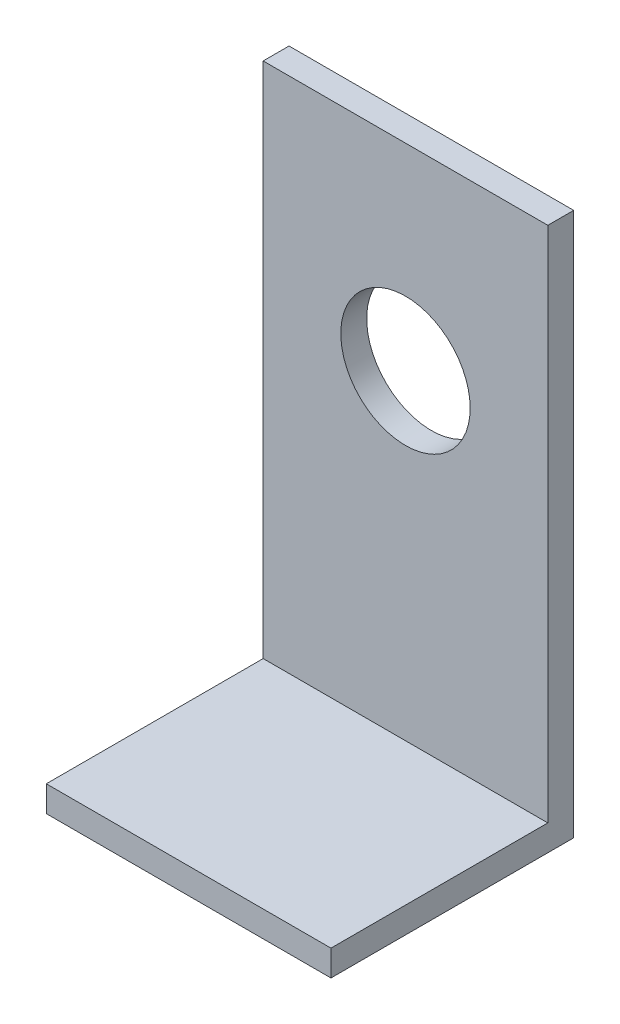
ISO-10303-21;
HEADER;
FILE_DESCRIPTION(('STEP AP214'),'2;1');
FILE_NAME('part.step','',(''),(''),'','','');
FILE_SCHEMA(('AUTOMOTIVE_DESIGN { 1 0 10303 214 1 1 1 1 }'));
ENDSEC;
DATA;
#1=APPLICATION_CONTEXT('core data for automotive mechanical design processes');
#2=APPLICATION_PROTOCOL_DEFINITION('international standard','automotive_design',2000,#1);
#3=PRODUCT_CONTEXT('',#1,'mechanical');
#4=PRODUCT('Part','Part','',(#3));
#5=PRODUCT_RELATED_PRODUCT_CATEGORY('part','',(#4));
#6=PRODUCT_DEFINITION_FORMATION('','',#4);
#7=PRODUCT_DEFINITION_CONTEXT('part definition',#1,'design');
#8=PRODUCT_DEFINITION('design','',#6,#7);
#9=PRODUCT_DEFINITION_SHAPE('','',#8);
#10=(LENGTH_UNIT() NAMED_UNIT(*) SI_UNIT(.MILLI.,.METRE.));
#11=(NAMED_UNIT(*) PLANE_ANGLE_UNIT() SI_UNIT($,.RADIAN.));
#12=(NAMED_UNIT(*) SI_UNIT($,.STERADIAN.) SOLID_ANGLE_UNIT());
#13=UNCERTAINTY_MEASURE_WITH_UNIT(LENGTH_MEASURE(1.E-05),#10,'distance_accuracy_value','');
#14=(GEOMETRIC_REPRESENTATION_CONTEXT(3) GLOBAL_UNCERTAINTY_ASSIGNED_CONTEXT((#13)) GLOBAL_UNIT_ASSIGNED_CONTEXT((#10,
#11,#12)) REPRESENTATION_CONTEXT('',''));
#15=CARTESIAN_POINT('',(0.,0.,0.));
#16=DIRECTION('',(0.,0.,1.));
#17=DIRECTION('',(1.,0.,0.));
#18=AXIS2_PLACEMENT_3D('',#15,#16,#17);
#19=CARTESIAN_POINT('',(0.,0.,5.));
#20=DIRECTION('',(0.,0.,-1.));
#21=DIRECTION('',(-1.,0.,0.));
#22=AXIS2_PLACEMENT_3D('',#19,#20,#21);
#23=PLANE('',#22);
#24=CARTESIAN_POINT('',(0.,66.9,5.));
#25=DIRECTION('',(0.,0.,1.));
#26=DIRECTION('',(1.,0.,0.));
#27=AXIS2_PLACEMENT_3D('',#24,#25,#26);
#28=CIRCLE('',#27,12.5);
#29=CARTESIAN_POINT('',(12.5,66.9,5.));
#30=VERTEX_POINT('',#29);
#31=EDGE_CURVE('E117',#30,#30,#28,.T.);
#32=ORIENTED_EDGE('',*,*,#31,.F.);
#33=EDGE_LOOP('',(#32));
#34=FACE_BOUND('',#33,.T.);
#35=DIRECTION('',(-1.,0.,0.));
#36=VECTOR('',#35,1.);
#37=CARTESIAN_POINT('',(-27.5,5.,5.));
#38=LINE('',#37,#36);
#39=CARTESIAN_POINT('',(27.5,4.99999999999999,5.));
#40=VERTEX_POINT('',#39);
#41=CARTESIAN_POINT('',(-27.5,5.,5.));
#42=VERTEX_POINT('',#41);
#43=EDGE_CURVE('E54',#40,#42,#38,.T.);
#44=ORIENTED_EDGE('',*,*,#43,.F.);
#45=DIRECTION('',(0.,1.,0.));
#46=VECTOR('',#45,1.);
#47=CARTESIAN_POINT('',(27.5,105.,5.));
#48=LINE('',#47,#46);
#49=CARTESIAN_POINT('',(27.5,105.,5.));
#50=VERTEX_POINT('',#49);
#51=EDGE_CURVE('E59',#40,#50,#48,.T.);
#52=ORIENTED_EDGE('',*,*,#51,.T.);
#53=DIRECTION('',(-1.,0.,0.));
#54=VECTOR('',#53,1.);
#55=CARTESIAN_POINT('',(-27.5,105.,5.));
#56=LINE('',#55,#54);
#57=CARTESIAN_POINT('',(-27.5,105.,5.));
#58=VERTEX_POINT('',#57);
#59=EDGE_CURVE('E97',#50,#58,#56,.T.);
#60=ORIENTED_EDGE('',*,*,#59,.T.);
#61=DIRECTION('',(0.,-1.,0.));
#62=VECTOR('',#61,1.);
#63=CARTESIAN_POINT('',(-27.5,0.,5.));
#64=LINE('',#63,#62);
#65=EDGE_CURVE('E103',#58,#42,#64,.T.);
#66=ORIENTED_EDGE('',*,*,#65,.T.);
#67=EDGE_LOOP('',(#44,#52,#60,#66));
#68=FACE_BOUND('',#67,.T.);
#69=ADVANCED_FACE('F39',(#34,#68),#23,.F.);
#70=CARTESIAN_POINT('',(0.,0.,0.));
#71=DIRECTION('',(0.,0.,-1.));
#72=DIRECTION('',(-1.,0.,0.));
#73=AXIS2_PLACEMENT_3D('',#70,#71,#72);
#74=PLANE('',#73);
#75=DIRECTION('',(0.,-1.,0.));
#76=VECTOR('',#75,1.);
#77=CARTESIAN_POINT('',(-27.5,0.,0.));
#78=LINE('',#77,#76);
#79=CARTESIAN_POINT('',(-27.5,105.,0.));
#80=VERTEX_POINT('',#79);
#81=CARTESIAN_POINT('',(-27.5,0.,0.));
#82=VERTEX_POINT('',#81);
#83=EDGE_CURVE('E101',#80,#82,#78,.T.);
#84=ORIENTED_EDGE('',*,*,#83,.F.);
#85=DIRECTION('',(-1.,0.,0.));
#86=VECTOR('',#85,1.);
#87=CARTESIAN_POINT('',(0.,105.,0.));
#88=LINE('',#87,#86);
#89=CARTESIAN_POINT('',(27.5,105.,0.));
#90=VERTEX_POINT('',#89);
#91=EDGE_CURVE('E90',#90,#80,#88,.T.);
#92=ORIENTED_EDGE('',*,*,#91,.F.);
#93=DIRECTION('',(0.,1.,0.));
#94=VECTOR('',#93,1.);
#95=CARTESIAN_POINT('',(27.5,105.,0.));
#96=LINE('',#95,#94);
#97=CARTESIAN_POINT('',(27.5,0.,0.));
#98=VERTEX_POINT('',#97);
#99=EDGE_CURVE('E80',#98,#90,#96,.T.);
#100=ORIENTED_EDGE('',*,*,#99,.F.);
#101=DIRECTION('',(1.,0.,0.));
#102=VECTOR('',#101,1.);
#103=CARTESIAN_POINT('',(27.5,0.,0.));
#104=LINE('',#103,#102);
#105=EDGE_CURVE('E91',#82,#98,#104,.T.);
#106=ORIENTED_EDGE('',*,*,#105,.F.);
#107=EDGE_LOOP('',(#84,#92,#100,#106));
#108=FACE_BOUND('',#107,.T.);
#109=CARTESIAN_POINT('',(0.,66.9,0.));
#110=DIRECTION('',(0.,0.,1.));
#111=DIRECTION('',(1.,0.,0.));
#112=AXIS2_PLACEMENT_3D('',#109,#110,#111);
#113=CIRCLE('',#112,12.5);
#114=CARTESIAN_POINT('',(12.5,66.9,0.));
#115=VERTEX_POINT('',#114);
#116=EDGE_CURVE('E122',#115,#115,#113,.T.);
#117=ORIENTED_EDGE('',*,*,#116,.T.);
#118=EDGE_LOOP('',(#117));
#119=FACE_BOUND('',#118,.T.);
#120=ADVANCED_FACE('F99',(#108,#119),#74,.T.);
#121=CARTESIAN_POINT('',(-27.5,0.,5.));
#122=DIRECTION('',(1.,0.,0.));
#123=DIRECTION('',(0.,1.,0.));
#124=AXIS2_PLACEMENT_3D('',#121,#122,#123);
#125=PLANE('',#124);
#126=ORIENTED_EDGE('',*,*,#83,.T.);
#127=DIRECTION('',(0.,0.,-1.));
#128=VECTOR('',#127,1.);
#129=CARTESIAN_POINT('',(-27.5,0.,5.));
#130=LINE('',#129,#128);
#131=CARTESIAN_POINT('',(-27.5,0.,46.9));
#132=VERTEX_POINT('',#131);
#133=EDGE_CURVE('E47',#132,#82,#130,.T.);
#134=ORIENTED_EDGE('',*,*,#133,.F.);
#135=DIRECTION('',(0.,-1.,0.));
#136=VECTOR('',#135,1.);
#137=CARTESIAN_POINT('',(-27.5,0.,46.9));
#138=LINE('',#137,#136);
#139=CARTESIAN_POINT('',(-27.5,5.,46.9));
#140=VERTEX_POINT('',#139);
#141=EDGE_CURVE('E133',#140,#132,#138,.T.);
#142=ORIENTED_EDGE('',*,*,#141,.F.);
#143=DIRECTION('',(0.,0.,-1.));
#144=VECTOR('',#143,1.);
#145=CARTESIAN_POINT('',(-27.5,5.,46.9));
#146=LINE('',#145,#144);
#147=EDGE_CURVE('E130',#140,#42,#146,.T.);
#148=ORIENTED_EDGE('',*,*,#147,.T.);
#149=ORIENTED_EDGE('',*,*,#65,.F.);
#150=DIRECTION('',(0.,0.,-1.));
#151=VECTOR('',#150,1.);
#152=CARTESIAN_POINT('',(-27.5,105.,5.));
#153=LINE('',#152,#151);
#154=EDGE_CURVE('E11',#58,#80,#153,.T.);
#155=ORIENTED_EDGE('',*,*,#154,.T.);
#156=EDGE_LOOP('',(#126,#134,#142,#148,#149,#155));
#157=FACE_BOUND('',#156,.T.);
#158=ADVANCED_FACE('F41',(#157),#125,.F.);
#159=CARTESIAN_POINT('',(27.5,0.,5.));
#160=DIRECTION('',(0.,1.,0.));
#161=DIRECTION('',(-1.,0.,0.));
#162=AXIS2_PLACEMENT_3D('',#159,#160,#161);
#163=PLANE('',#162);
#164=ORIENTED_EDGE('',*,*,#105,.T.);
#165=DIRECTION('',(0.,0.,-1.));
#166=VECTOR('',#165,1.);
#167=CARTESIAN_POINT('',(27.5,0.,5.));
#168=LINE('',#167,#166);
#169=CARTESIAN_POINT('',(27.5,0.,46.9));
#170=VERTEX_POINT('',#169);
#171=EDGE_CURVE('E86',#170,#98,#168,.T.);
#172=ORIENTED_EDGE('',*,*,#171,.F.);
#173=DIRECTION('',(1.,0.,0.));
#174=VECTOR('',#173,1.);
#175=CARTESIAN_POINT('',(27.5,0.,46.9));
#176=LINE('',#175,#174);
#177=EDGE_CURVE('E113',#132,#170,#176,.T.);
#178=ORIENTED_EDGE('',*,*,#177,.F.);
#179=ORIENTED_EDGE('',*,*,#133,.T.);
#180=EDGE_LOOP('',(#164,#172,#178,#179));
#181=FACE_BOUND('',#180,.T.);
#182=ADVANCED_FACE('F111',(#181),#163,.F.);
#183=CARTESIAN_POINT('',(27.5,105.,5.));
#184=DIRECTION('',(-1.,0.,0.));
#185=DIRECTION('',(0.,-1.,0.));
#186=AXIS2_PLACEMENT_3D('',#183,#184,#185);
#187=PLANE('',#186);
#188=ORIENTED_EDGE('',*,*,#99,.T.);
#189=DIRECTION('',(0.,0.,-1.));
#190=VECTOR('',#189,1.);
#191=CARTESIAN_POINT('',(27.5,105.,5.));
#192=LINE('',#191,#190);
#193=EDGE_CURVE('E83',#50,#90,#192,.T.);
#194=ORIENTED_EDGE('',*,*,#193,.F.);
#195=ORIENTED_EDGE('',*,*,#51,.F.);
#196=DIRECTION('',(0.,0.,-1.));
#197=VECTOR('',#196,1.);
#198=CARTESIAN_POINT('',(27.5,5.,46.9));
#199=LINE('',#198,#197);
#200=CARTESIAN_POINT('',(27.5,5.,46.9));
#201=VERTEX_POINT('',#200);
#202=EDGE_CURVE('E125',#201,#40,#199,.T.);
#203=ORIENTED_EDGE('',*,*,#202,.F.);
#204=DIRECTION('',(0.,1.,0.));
#205=VECTOR('',#204,1.);
#206=CARTESIAN_POINT('',(27.5,5.,46.9));
#207=LINE('',#206,#205);
#208=EDGE_CURVE('E139',#170,#201,#207,.T.);
#209=ORIENTED_EDGE('',*,*,#208,.F.);
#210=ORIENTED_EDGE('',*,*,#171,.T.);
#211=EDGE_LOOP('',(#188,#194,#195,#203,#209,#210));
#212=FACE_BOUND('',#211,.T.);
#213=ADVANCED_FACE('F82',(#212),#187,.F.);
#214=CARTESIAN_POINT('',(0.,105.,5.));
#215=DIRECTION('',(0.,-1.,0.));
#216=DIRECTION('',(1.,0.,0.));
#217=AXIS2_PLACEMENT_3D('',#214,#215,#216);
#218=PLANE('',#217);
#219=ORIENTED_EDGE('',*,*,#91,.T.);
#220=ORIENTED_EDGE('',*,*,#154,.F.);
#221=ORIENTED_EDGE('',*,*,#59,.F.);
#222=ORIENTED_EDGE('',*,*,#193,.T.);
#223=EDGE_LOOP('',(#219,#220,#221,#222));
#224=FACE_BOUND('',#223,.T.);
#225=ADVANCED_FACE('F94',(#224),#218,.F.);
#226=CARTESIAN_POINT('',(0.,66.9,5.));
#227=DIRECTION('',(0.,0.,-1.));
#228=DIRECTION('',(-1.,0.,0.));
#229=AXIS2_PLACEMENT_3D('',#226,#227,#228);
#230=CYLINDRICAL_SURFACE('',#229,12.5);
#231=ORIENTED_EDGE('',*,*,#31,.T.);
#232=EDGE_LOOP('',(#231));
#233=FACE_BOUND('',#232,.T.);
#234=ORIENTED_EDGE('',*,*,#116,.F.);
#235=EDGE_LOOP('',(#234));
#236=FACE_BOUND('',#235,.T.);
#237=ADVANCED_FACE('F171',(#233,#236),#230,.F.);
#238=CARTESIAN_POINT('',(-27.5,5.,46.9));
#239=DIRECTION('',(0.,-1.,0.));
#240=DIRECTION('',(0.,0.,-1.));
#241=AXIS2_PLACEMENT_3D('',#238,#239,#240);
#242=PLANE('',#241);
#243=ORIENTED_EDGE('',*,*,#43,.T.);
#244=ORIENTED_EDGE('',*,*,#147,.F.);
#245=DIRECTION('',(-1.,0.,0.));
#246=VECTOR('',#245,1.);
#247=CARTESIAN_POINT('',(-27.5,5.,46.9));
#248=LINE('',#247,#246);
#249=EDGE_CURVE('E136',#201,#140,#248,.T.);
#250=ORIENTED_EDGE('',*,*,#249,.F.);
#251=ORIENTED_EDGE('',*,*,#202,.T.);
#252=EDGE_LOOP('',(#243,#244,#250,#251));
#253=FACE_BOUND('',#252,.T.);
#254=ADVANCED_FACE('F156',(#253),#242,.F.);
#255=CARTESIAN_POINT('',(0.,0.,46.9));
#256=DIRECTION('',(0.,0.,-1.));
#257=DIRECTION('',(-1.,0.,0.));
#258=AXIS2_PLACEMENT_3D('',#255,#256,#257);
#259=PLANE('',#258);
#260=ORIENTED_EDGE('',*,*,#177,.T.);
#261=ORIENTED_EDGE('',*,*,#208,.T.);
#262=ORIENTED_EDGE('',*,*,#249,.T.);
#263=ORIENTED_EDGE('',*,*,#141,.T.);
#264=EDGE_LOOP('',(#260,#261,#262,#263));
#265=FACE_BOUND('',#264,.T.);
#266=ADVANCED_FACE('F144',(#265),#259,.F.);
#267=CLOSED_SHELL('',(#69,#120,#158,#182,#213,#225,#237,#254,#266));
#268=MANIFOLD_SOLID_BREP('B2',#267);
#269=ADVANCED_BREP_SHAPE_REPRESENTATION('',(#18,#268),#14);
#270=SHAPE_DEFINITION_REPRESENTATION(#9,#269);
ENDSEC;
END-ISO-10303-21;
